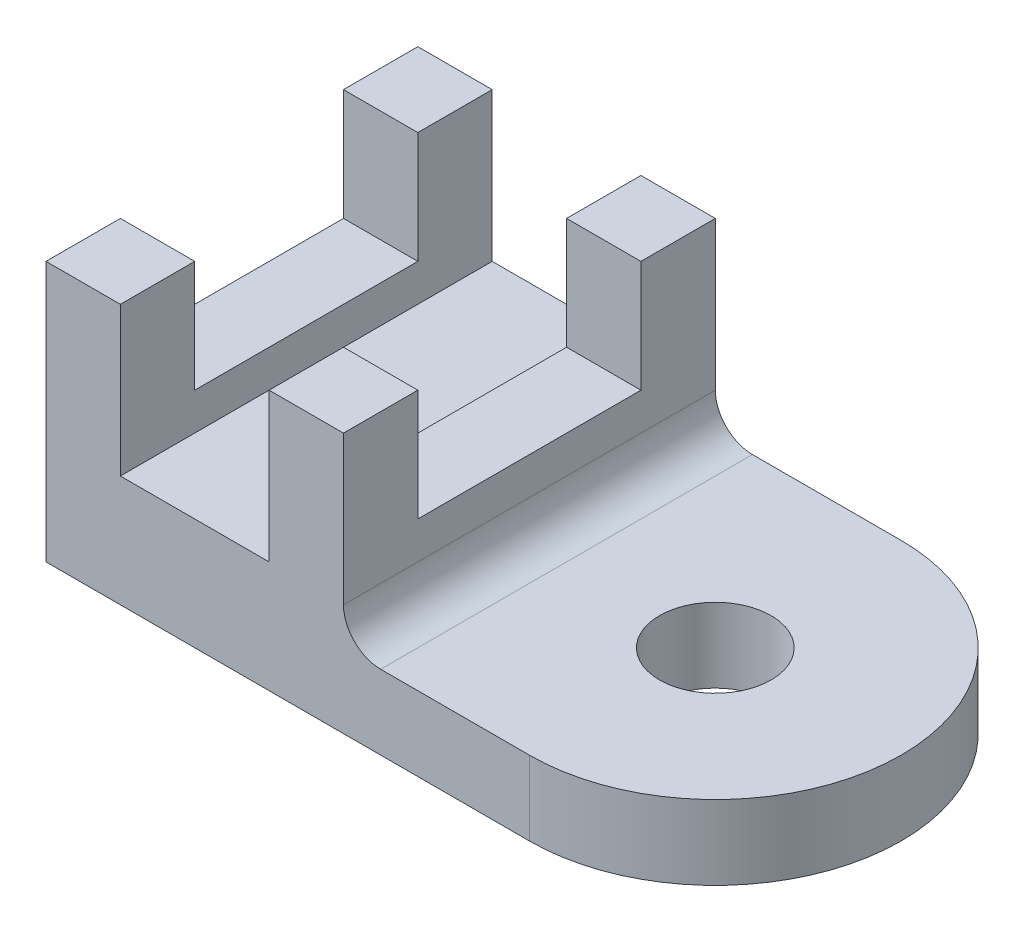
ISO-10303-21;
HEADER;
FILE_DESCRIPTION(('STEP AP214'),'2;1');
FILE_NAME('part.step','',(''),(''),'','','');
FILE_SCHEMA(('AUTOMOTIVE_DESIGN { 1 0 10303 214 1 1 1 1 }'));
ENDSEC;
DATA;
#1=APPLICATION_CONTEXT('core data for automotive mechanical design processes');
#2=APPLICATION_PROTOCOL_DEFINITION('international standard','automotive_design',2000,#1);
#3=PRODUCT_CONTEXT('',#1,'mechanical');
#4=PRODUCT('Part','Part','',(#3));
#5=PRODUCT_RELATED_PRODUCT_CATEGORY('part','',(#4));
#6=PRODUCT_DEFINITION_FORMATION('','',#4);
#7=PRODUCT_DEFINITION_CONTEXT('part definition',#1,'design');
#8=PRODUCT_DEFINITION('design','',#6,#7);
#9=PRODUCT_DEFINITION_SHAPE('','',#8);
#10=(LENGTH_UNIT() NAMED_UNIT(*) SI_UNIT(.MILLI.,.METRE.));
#11=(NAMED_UNIT(*) PLANE_ANGLE_UNIT() SI_UNIT($,.RADIAN.));
#12=(NAMED_UNIT(*) SI_UNIT($,.STERADIAN.) SOLID_ANGLE_UNIT());
#13=UNCERTAINTY_MEASURE_WITH_UNIT(LENGTH_MEASURE(1.E-05),#10,'distance_accuracy_value','');
#14=(GEOMETRIC_REPRESENTATION_CONTEXT(3) GLOBAL_UNCERTAINTY_ASSIGNED_CONTEXT((#13)) GLOBAL_UNIT_ASSIGNED_CONTEXT((#10,
#11,#12)) REPRESENTATION_CONTEXT('',''));
#15=CARTESIAN_POINT('',(0.,0.,0.));
#16=DIRECTION('',(0.,0.,1.));
#17=DIRECTION('',(1.,0.,0.));
#18=AXIS2_PLACEMENT_3D('',#15,#16,#17);
#19=CARTESIAN_POINT('',(0.,19.05,0.));
#20=DIRECTION('',(0.,1.,0.));
#21=DIRECTION('',(0.,0.,1.));
#22=AXIS2_PLACEMENT_3D('',#19,#20,#21);
#23=PLANE('',#22);
#24=DIRECTION('',(1.,0.,0.));
#25=VECTOR('',#24,1.);
#26=CARTESIAN_POINT('',(0.,19.05,0.));
#27=LINE('',#26,#25);
#28=CARTESIAN_POINT('',(12.7,19.05,0.));
#29=VERTEX_POINT('',#28);
#30=CARTESIAN_POINT('',(38.1,19.05,0.));
#31=VERTEX_POINT('',#30);
#32=EDGE_CURVE('E262',#29,#31,#27,.T.);
#33=ORIENTED_EDGE('',*,*,#32,.T.);
#34=DIRECTION('',(0.,0.,1.));
#35=VECTOR('',#34,1.);
#36=CARTESIAN_POINT('',(38.1,19.05,0.));
#37=LINE('',#36,#35);
#38=CARTESIAN_POINT('',(38.1,19.05,-63.5));
#39=VERTEX_POINT('',#38);
#40=EDGE_CURVE('E193',#39,#31,#37,.T.);
#41=ORIENTED_EDGE('',*,*,#40,.F.);
#42=DIRECTION('',(1.,0.,0.));
#43=VECTOR('',#42,1.);
#44=CARTESIAN_POINT('',(0.,19.05,-63.5));
#45=LINE('',#44,#43);
#46=CARTESIAN_POINT('',(12.7,19.05,-63.5));
#47=VERTEX_POINT('',#46);
#48=EDGE_CURVE('E259',#47,#39,#45,.T.);
#49=ORIENTED_EDGE('',*,*,#48,.F.);
#50=DIRECTION('',(0.,0.,1.));
#51=VECTOR('',#50,1.);
#52=CARTESIAN_POINT('',(12.7,19.05,0.));
#53=LINE('',#52,#51);
#54=EDGE_CURVE('E237',#47,#29,#53,.T.);
#55=ORIENTED_EDGE('',*,*,#54,.T.);
#56=EDGE_LOOP('',(#33,#41,#49,#55));
#57=FACE_BOUND('',#56,.T.);
#58=ADVANCED_FACE('F39',(#57),#23,.T.);
#59=CARTESIAN_POINT('',(82.55,12.7,-31.75));
#60=DIRECTION('',(0.,-1.,0.));
#61=DIRECTION('',(0.,0.,-1.));
#62=AXIS2_PLACEMENT_3D('',#59,#60,#61);
#63=CYLINDRICAL_SURFACE('',#62,31.75);
#64=CARTESIAN_POINT('',(82.55,0.,-31.75));
#65=DIRECTION('',(0.,1.,0.));
#66=DIRECTION('',(0.,0.,1.));
#67=AXIS2_PLACEMENT_3D('',#64,#65,#66);
#68=CIRCLE('',#67,31.75);
#69=CARTESIAN_POINT('',(82.55,0.,0.));
#70=VERTEX_POINT('',#69);
#71=CARTESIAN_POINT('',(82.55,0.,-63.5));
#72=VERTEX_POINT('',#71);
#73=EDGE_CURVE('E277',#70,#72,#68,.T.);
#74=ORIENTED_EDGE('',*,*,#73,.T.);
#75=DIRECTION('',(0.,-1.,0.));
#76=VECTOR('',#75,1.);
#77=CARTESIAN_POINT('',(82.55,12.7,-63.5));
#78=LINE('',#77,#76);
#79=CARTESIAN_POINT('',(82.55,12.7,-63.5));
#80=VERTEX_POINT('',#79);
#81=EDGE_CURVE('E301',#80,#72,#78,.T.);
#82=ORIENTED_EDGE('',*,*,#81,.F.);
#83=CARTESIAN_POINT('',(82.55,12.7,-31.75));
#84=DIRECTION('',(0.,1.,0.));
#85=DIRECTION('',(0.,0.,1.));
#86=AXIS2_PLACEMENT_3D('',#83,#84,#85);
#87=CIRCLE('',#86,31.75);
#88=CARTESIAN_POINT('',(82.55,12.7,0.));
#89=VERTEX_POINT('',#88);
#90=EDGE_CURVE('E278',#89,#80,#87,.T.);
#91=ORIENTED_EDGE('',*,*,#90,.F.);
#92=DIRECTION('',(0.,-1.,0.));
#93=VECTOR('',#92,1.);
#94=CARTESIAN_POINT('',(82.55,12.7,0.));
#95=LINE('',#94,#93);
#96=EDGE_CURVE('E289',#89,#70,#95,.T.);
#97=ORIENTED_EDGE('',*,*,#96,.T.);
#98=EDGE_LOOP('',(#74,#82,#91,#97));
#99=FACE_BOUND('',#98,.T.);
#100=ADVANCED_FACE('F319',(#99),#63,.T.);
#101=CARTESIAN_POINT('',(0.,12.7,-63.5));
#102=DIRECTION('',(0.,0.,-1.));
#103=DIRECTION('',(-1.,0.,0.));
#104=AXIS2_PLACEMENT_3D('',#101,#102,#103);
#105=PLANE('',#104);
#106=DIRECTION('',(1.,0.,0.));
#107=VECTOR('',#106,1.);
#108=CARTESIAN_POINT('',(0.,0.,-63.5));
#109=LINE('',#108,#107);
#110=CARTESIAN_POINT('',(0.,0.,-63.5));
#111=VERTEX_POINT('',#110);
#112=EDGE_CURVE('E292',#111,#72,#109,.T.);
#113=ORIENTED_EDGE('',*,*,#112,.F.);
#114=DIRECTION('',(0.,-1.,0.));
#115=VECTOR('',#114,1.);
#116=CARTESIAN_POINT('',(0.,19.05,-63.5));
#117=LINE('',#116,#115);
#118=CARTESIAN_POINT('',(0.,44.45,-63.5));
#119=VERTEX_POINT('',#118);
#120=EDGE_CURVE('E274',#119,#111,#117,.T.);
#121=ORIENTED_EDGE('',*,*,#120,.F.);
#122=DIRECTION('',(-1.,0.,0.));
#123=VECTOR('',#122,1.);
#124=CARTESIAN_POINT('',(0.,44.45,-63.5));
#125=LINE('',#124,#123);
#126=CARTESIAN_POINT('',(12.7,44.45,-63.5));
#127=VERTEX_POINT('',#126);
#128=EDGE_CURVE('E246',#127,#119,#125,.T.);
#129=ORIENTED_EDGE('',*,*,#128,.F.);
#130=DIRECTION('',(0.,-1.,0.));
#131=VECTOR('',#130,1.);
#132=CARTESIAN_POINT('',(12.7,44.45,-63.5));
#133=LINE('',#132,#131);
#134=EDGE_CURVE('E249',#127,#47,#133,.T.);
#135=ORIENTED_EDGE('',*,*,#134,.T.);
#136=ORIENTED_EDGE('',*,*,#48,.T.);
#137=DIRECTION('',(0.,-1.,0.));
#138=VECTOR('',#137,1.);
#139=CARTESIAN_POINT('',(38.1,44.45,-63.5));
#140=LINE('',#139,#138);
#141=CARTESIAN_POINT('',(38.1,44.45,-63.5));
#142=VERTEX_POINT('',#141);
#143=EDGE_CURVE('E210',#142,#39,#140,.T.);
#144=ORIENTED_EDGE('',*,*,#143,.F.);
#145=DIRECTION('',(-1.,0.,0.));
#146=VECTOR('',#145,1.);
#147=CARTESIAN_POINT('',(0.,44.45,-63.5));
#148=LINE('',#147,#146);
#149=CARTESIAN_POINT('',(50.8,44.45,-63.5));
#150=VERTEX_POINT('',#149);
#151=EDGE_CURVE('E209',#150,#142,#148,.T.);
#152=ORIENTED_EDGE('',*,*,#151,.F.);
#153=DIRECTION('',(0.,-1.,0.));
#154=VECTOR('',#153,1.);
#155=CARTESIAN_POINT('',(50.8,19.05,-63.5));
#156=LINE('',#155,#154);
#157=CARTESIAN_POINT('',(50.8,19.05,-63.5));
#158=VERTEX_POINT('',#157);
#159=EDGE_CURVE('E265',#150,#158,#156,.T.);
#160=ORIENTED_EDGE('',*,*,#159,.T.);
#161=CARTESIAN_POINT('',(57.15,19.05,-63.5));
#162=DIRECTION('',(0.,0.,-1.));
#163=DIRECTION('',(-1.,0.,0.));
#164=AXIS2_PLACEMENT_3D('',#161,#162,#163);
#165=CIRCLE('',#164,6.35);
#166=CARTESIAN_POINT('',(57.15,12.7,-63.5));
#167=VERTEX_POINT('',#166);
#168=EDGE_CURVE('E11',#158,#167,#165,.F.);
#169=ORIENTED_EDGE('',*,*,#168,.T.);
#170=DIRECTION('',(1.,0.,0.));
#171=VECTOR('',#170,1.);
#172=CARTESIAN_POINT('',(0.,12.7,-63.5));
#173=LINE('',#172,#171);
#174=EDGE_CURVE('E281',#167,#80,#173,.T.);
#175=ORIENTED_EDGE('',*,*,#174,.T.);
#176=ORIENTED_EDGE('',*,*,#81,.T.);
#177=EDGE_LOOP('',(#113,#121,#129,#135,#136,#144,#152,#160,#169,#175,#176));
#178=FACE_BOUND('',#177,.T.);
#179=ADVANCED_FACE('F321',(#178),#105,.T.);
#180=CARTESIAN_POINT('',(0.,12.7,0.));
#181=DIRECTION('',(0.,0.,-1.));
#182=DIRECTION('',(-1.,0.,0.));
#183=AXIS2_PLACEMENT_3D('',#180,#181,#182);
#184=PLANE('',#183);
#185=DIRECTION('',(1.,0.,0.));
#186=VECTOR('',#185,1.);
#187=CARTESIAN_POINT('',(0.,0.,0.));
#188=LINE('',#187,#186);
#189=CARTESIAN_POINT('',(0.,0.,0.));
#190=VERTEX_POINT('',#189);
#191=EDGE_CURVE('E295',#190,#70,#188,.T.);
#192=ORIENTED_EDGE('',*,*,#191,.T.);
#193=ORIENTED_EDGE('',*,*,#96,.F.);
#194=DIRECTION('',(1.,0.,0.));
#195=VECTOR('',#194,1.);
#196=CARTESIAN_POINT('',(0.,12.7,0.));
#197=LINE('',#196,#195);
#198=CARTESIAN_POINT('',(57.15,12.7,0.));
#199=VERTEX_POINT('',#198);
#200=EDGE_CURVE('E284',#199,#89,#197,.T.);
#201=ORIENTED_EDGE('',*,*,#200,.F.);
#202=CARTESIAN_POINT('',(57.15,19.05,0.));
#203=DIRECTION('',(0.,0.,-1.));
#204=DIRECTION('',(-1.,0.,0.));
#205=AXIS2_PLACEMENT_3D('',#202,#203,#204);
#206=CIRCLE('',#205,6.35);
#207=CARTESIAN_POINT('',(50.8,19.05,0.));
#208=VERTEX_POINT('',#207);
#209=EDGE_CURVE('E47',#199,#208,#206,.T.);
#210=ORIENTED_EDGE('',*,*,#209,.T.);
#211=DIRECTION('',(0.,-1.,0.));
#212=VECTOR('',#211,1.);
#213=CARTESIAN_POINT('',(50.8,19.05,0.));
#214=LINE('',#213,#212);
#215=CARTESIAN_POINT('',(50.8,44.45,0.));
#216=VERTEX_POINT('',#215);
#217=EDGE_CURVE('E269',#216,#208,#214,.T.);
#218=ORIENTED_EDGE('',*,*,#217,.F.);
#219=DIRECTION('',(1.,0.,0.));
#220=VECTOR('',#219,1.);
#221=CARTESIAN_POINT('',(0.,44.45,0.));
#222=LINE('',#221,#220);
#223=CARTESIAN_POINT('',(38.1,44.45,0.));
#224=VERTEX_POINT('',#223);
#225=EDGE_CURVE('E655',#224,#216,#222,.T.);
#226=ORIENTED_EDGE('',*,*,#225,.F.);
#227=DIRECTION('',(0.,-1.,0.));
#228=VECTOR('',#227,1.);
#229=CARTESIAN_POINT('',(38.1,44.45,0.));
#230=LINE('',#229,#228);
#231=EDGE_CURVE('E194',#224,#31,#230,.T.);
#232=ORIENTED_EDGE('',*,*,#231,.T.);
#233=ORIENTED_EDGE('',*,*,#32,.F.);
#234=DIRECTION('',(0.,-1.,0.));
#235=VECTOR('',#234,1.);
#236=CARTESIAN_POINT('',(12.7,44.45,0.));
#237=LINE('',#236,#235);
#238=CARTESIAN_POINT('',(12.7,44.45,0.));
#239=VERTEX_POINT('',#238);
#240=EDGE_CURVE('E231',#239,#29,#237,.T.);
#241=ORIENTED_EDGE('',*,*,#240,.F.);
#242=DIRECTION('',(1.,0.,0.));
#243=VECTOR('',#242,1.);
#244=CARTESIAN_POINT('',(0.,44.45,0.));
#245=LINE('',#244,#243);
#246=CARTESIAN_POINT('',(0.,44.45,0.));
#247=VERTEX_POINT('',#246);
#248=EDGE_CURVE('E224',#247,#239,#245,.T.);
#249=ORIENTED_EDGE('',*,*,#248,.F.);
#250=DIRECTION('',(0.,-1.,0.));
#251=VECTOR('',#250,1.);
#252=CARTESIAN_POINT('',(0.,19.05,0.));
#253=LINE('',#252,#251);
#254=EDGE_CURVE('E271',#247,#190,#253,.T.);
#255=ORIENTED_EDGE('',*,*,#254,.T.);
#256=EDGE_LOOP('',(#192,#193,#201,#210,#218,#226,#232,#233,#241,#249,#255));
#257=FACE_BOUND('',#256,.T.);
#258=ADVANCED_FACE('F314',(#257),#184,.F.);
#259=CARTESIAN_POINT('',(82.55,12.7,-31.75));
#260=DIRECTION('',(0.,-1.,0.));
#261=DIRECTION('',(0.,0.,-1.));
#262=AXIS2_PLACEMENT_3D('',#259,#260,#261);
#263=CYLINDRICAL_SURFACE('',#262,9.52500000000001);
#264=CARTESIAN_POINT('',(82.55,12.7,-31.75));
#265=DIRECTION('',(0.,1.,0.));
#266=DIRECTION('',(0.,0.,1.));
#267=AXIS2_PLACEMENT_3D('',#264,#265,#266);
#268=CIRCLE('',#267,9.52500000000001);
#269=CARTESIAN_POINT('',(82.55,12.7,-22.225));
#270=VERTEX_POINT('',#269);
#271=EDGE_CURVE('E286',#270,#270,#268,.T.);
#272=ORIENTED_EDGE('',*,*,#271,.T.);
#273=EDGE_LOOP('',(#272));
#274=FACE_BOUND('',#273,.T.);
#275=CARTESIAN_POINT('',(82.55,0.,-31.75));
#276=DIRECTION('',(0.,1.,0.));
#277=DIRECTION('',(0.,0.,1.));
#278=AXIS2_PLACEMENT_3D('',#275,#276,#277);
#279=CIRCLE('',#278,9.52500000000001);
#280=CARTESIAN_POINT('',(82.55,0.,-22.225));
#281=VERTEX_POINT('',#280);
#282=EDGE_CURVE('E282',#281,#281,#279,.T.);
#283=ORIENTED_EDGE('',*,*,#282,.F.);
#284=EDGE_LOOP('',(#283));
#285=FACE_BOUND('',#284,.T.);
#286=ADVANCED_FACE('F349',(#274,#285),#263,.F.);
#287=CARTESIAN_POINT('',(0.,12.7,0.));
#288=DIRECTION('',(0.,1.,0.));
#289=DIRECTION('',(0.,0.,1.));
#290=AXIS2_PLACEMENT_3D('',#287,#288,#289);
#291=PLANE('',#290);
#292=ORIENTED_EDGE('',*,*,#174,.F.);
#293=DIRECTION('',(0.,0.,1.));
#294=VECTOR('',#293,1.);
#295=CARTESIAN_POINT('',(57.15,12.7,0.));
#296=LINE('',#295,#294);
#297=EDGE_CURVE('E303',#167,#199,#296,.T.);
#298=ORIENTED_EDGE('',*,*,#297,.T.);
#299=ORIENTED_EDGE('',*,*,#200,.T.);
#300=ORIENTED_EDGE('',*,*,#90,.T.);
#301=EDGE_LOOP('',(#292,#298,#299,#300));
#302=FACE_BOUND('',#301,.T.);
#303=ORIENTED_EDGE('',*,*,#271,.F.);
#304=EDGE_LOOP('',(#303));
#305=FACE_BOUND('',#304,.T.);
#306=ADVANCED_FACE('F309',(#302,#305),#291,.T.);
#307=CARTESIAN_POINT('',(0.,0.,0.));
#308=DIRECTION('',(0.,1.,0.));
#309=DIRECTION('',(0.,0.,1.));
#310=AXIS2_PLACEMENT_3D('',#307,#308,#309);
#311=PLANE('',#310);
#312=ORIENTED_EDGE('',*,*,#73,.F.);
#313=ORIENTED_EDGE('',*,*,#191,.F.);
#314=DIRECTION('',(0.,0.,-1.));
#315=VECTOR('',#314,1.);
#316=CARTESIAN_POINT('',(0.,0.,0.));
#317=LINE('',#316,#315);
#318=EDGE_CURVE('E258',#190,#111,#317,.T.);
#319=ORIENTED_EDGE('',*,*,#318,.T.);
#320=ORIENTED_EDGE('',*,*,#112,.T.);
#321=EDGE_LOOP('',(#312,#313,#319,#320));
#322=FACE_BOUND('',#321,.T.);
#323=ORIENTED_EDGE('',*,*,#282,.T.);
#324=EDGE_LOOP('',(#323));
#325=FACE_BOUND('',#324,.T.);
#326=ADVANCED_FACE('F343',(#322,#325),#311,.F.);
#327=CARTESIAN_POINT('',(50.8,19.05,0.));
#328=DIRECTION('',(1.,0.,0.));
#329=DIRECTION('',(0.,0.,-1.));
#330=AXIS2_PLACEMENT_3D('',#327,#328,#329);
#331=PLANE('',#330);
#332=ORIENTED_EDGE('',*,*,#217,.T.);
#333=DIRECTION('',(0.,0.,1.));
#334=VECTOR('',#333,1.);
#335=CARTESIAN_POINT('',(50.8,19.05,-63.5));
#336=LINE('',#335,#334);
#337=EDGE_CURVE('E60',#208,#158,#336,.F.);
#338=ORIENTED_EDGE('',*,*,#337,.T.);
#339=ORIENTED_EDGE('',*,*,#159,.F.);
#340=DIRECTION('',(0.,0.,-1.));
#341=VECTOR('',#340,1.);
#342=CARTESIAN_POINT('',(50.8,44.45,0.));
#343=LINE('',#342,#341);
#344=CARTESIAN_POINT('',(50.8,44.45,-50.8));
#345=VERTEX_POINT('',#344);
#346=EDGE_CURVE('E206',#345,#150,#343,.T.);
#347=ORIENTED_EDGE('',*,*,#346,.F.);
#348=DIRECTION('',(0.,-1.,0.));
#349=VECTOR('',#348,1.);
#350=CARTESIAN_POINT('',(50.8,44.45,-50.8));
#351=LINE('',#350,#349);
#352=CARTESIAN_POINT('',(50.8,25.4,-50.8));
#353=VERTEX_POINT('',#352);
#354=EDGE_CURVE('E213',#345,#353,#351,.T.);
#355=ORIENTED_EDGE('',*,*,#354,.T.);
#356=DIRECTION('',(0.,0.,-1.));
#357=VECTOR('',#356,1.);
#358=CARTESIAN_POINT('',(50.8,25.4,0.));
#359=LINE('',#358,#357);
#360=CARTESIAN_POINT('',(50.8,25.4,-12.7));
#361=VERTEX_POINT('',#360);
#362=EDGE_CURVE('E187',#361,#353,#359,.T.);
#363=ORIENTED_EDGE('',*,*,#362,.F.);
#364=DIRECTION('',(0.,-1.,0.));
#365=VECTOR('',#364,1.);
#366=CARTESIAN_POINT('',(50.8,44.45,-12.7));
#367=LINE('',#366,#365);
#368=CARTESIAN_POINT('',(50.8,44.45,-12.7));
#369=VERTEX_POINT('',#368);
#370=EDGE_CURVE('E186',#369,#361,#367,.T.);
#371=ORIENTED_EDGE('',*,*,#370,.F.);
#372=DIRECTION('',(0.,0.,-1.));
#373=VECTOR('',#372,1.);
#374=CARTESIAN_POINT('',(50.8,44.45,0.));
#375=LINE('',#374,#373);
#376=EDGE_CURVE('E658',#216,#369,#375,.T.);
#377=ORIENTED_EDGE('',*,*,#376,.F.);
#378=EDGE_LOOP('',(#332,#338,#339,#347,#355,#363,#371,#377));
#379=FACE_BOUND('',#378,.T.);
#380=ADVANCED_FACE('F339',(#379),#331,.T.);
#381=CARTESIAN_POINT('',(0.,19.05,0.));
#382=DIRECTION('',(-1.,0.,0.));
#383=DIRECTION('',(0.,0.,1.));
#384=AXIS2_PLACEMENT_3D('',#381,#382,#383);
#385=PLANE('',#384);
#386=ORIENTED_EDGE('',*,*,#318,.F.);
#387=ORIENTED_EDGE('',*,*,#254,.F.);
#388=DIRECTION('',(0.,0.,1.));
#389=VECTOR('',#388,1.);
#390=CARTESIAN_POINT('',(0.,44.45,0.));
#391=LINE('',#390,#389);
#392=CARTESIAN_POINT('',(0.,44.45,-12.7));
#393=VERTEX_POINT('',#392);
#394=EDGE_CURVE('E221',#393,#247,#391,.T.);
#395=ORIENTED_EDGE('',*,*,#394,.F.);
#396=DIRECTION('',(0.,-1.,0.));
#397=VECTOR('',#396,1.);
#398=CARTESIAN_POINT('',(0.,44.45,-12.7));
#399=LINE('',#398,#397);
#400=CARTESIAN_POINT('',(0.,25.4,-12.7));
#401=VERTEX_POINT('',#400);
#402=EDGE_CURVE('E234',#393,#401,#399,.T.);
#403=ORIENTED_EDGE('',*,*,#402,.T.);
#404=DIRECTION('',(0.,0.,1.));
#405=VECTOR('',#404,1.);
#406=CARTESIAN_POINT('',(0.,25.4,0.));
#407=LINE('',#406,#405);
#408=CARTESIAN_POINT('',(0.,25.4,-50.8));
#409=VERTEX_POINT('',#408);
#410=EDGE_CURVE('E638',#409,#401,#407,.T.);
#411=ORIENTED_EDGE('',*,*,#410,.F.);
#412=DIRECTION('',(0.,-1.,0.));
#413=VECTOR('',#412,1.);
#414=CARTESIAN_POINT('',(0.,44.45,-50.8));
#415=LINE('',#414,#413);
#416=CARTESIAN_POINT('',(0.,44.45,-50.8));
#417=VERTEX_POINT('',#416);
#418=EDGE_CURVE('E256',#417,#409,#415,.T.);
#419=ORIENTED_EDGE('',*,*,#418,.F.);
#420=DIRECTION('',(0.,0.,1.));
#421=VECTOR('',#420,1.);
#422=CARTESIAN_POINT('',(0.,44.45,0.));
#423=LINE('',#422,#421);
#424=EDGE_CURVE('E238',#119,#417,#423,.T.);
#425=ORIENTED_EDGE('',*,*,#424,.F.);
#426=ORIENTED_EDGE('',*,*,#120,.T.);
#427=EDGE_LOOP('',(#386,#387,#395,#403,#411,#419,#425,#426));
#428=FACE_BOUND('',#427,.T.);
#429=ADVANCED_FACE('F342',(#428),#385,.T.);
#430=CARTESIAN_POINT('',(0.,44.45,-50.8));
#431=DIRECTION('',(0.,0.,-1.));
#432=DIRECTION('',(-1.,0.,0.));
#433=AXIS2_PLACEMENT_3D('',#430,#431,#432);
#434=PLANE('',#433);
#435=ORIENTED_EDGE('',*,*,#418,.T.);
#436=DIRECTION('',(1.,0.,0.));
#437=VECTOR('',#436,1.);
#438=CARTESIAN_POINT('',(0.,25.4,-50.8));
#439=LINE('',#438,#437);
#440=CARTESIAN_POINT('',(12.7,25.4,-50.8));
#441=VERTEX_POINT('',#440);
#442=EDGE_CURVE('E642',#409,#441,#439,.T.);
#443=ORIENTED_EDGE('',*,*,#442,.T.);
#444=DIRECTION('',(0.,-1.,0.));
#445=VECTOR('',#444,1.);
#446=CARTESIAN_POINT('',(12.7,44.45,-50.8));
#447=LINE('',#446,#445);
#448=CARTESIAN_POINT('',(12.7,44.45,-50.8));
#449=VERTEX_POINT('',#448);
#450=EDGE_CURVE('E253',#449,#441,#447,.T.);
#451=ORIENTED_EDGE('',*,*,#450,.F.);
#452=DIRECTION('',(1.,0.,0.));
#453=VECTOR('',#452,1.);
#454=CARTESIAN_POINT('',(0.,44.45,-50.8));
#455=LINE('',#454,#453);
#456=EDGE_CURVE('E241',#417,#449,#455,.T.);
#457=ORIENTED_EDGE('',*,*,#456,.F.);
#458=EDGE_LOOP('',(#435,#443,#451,#457));
#459=FACE_BOUND('',#458,.T.);
#460=ADVANCED_FACE('F337',(#459),#434,.F.);
#461=CARTESIAN_POINT('',(12.7,44.45,0.));
#462=DIRECTION('',(1.,0.,0.));
#463=DIRECTION('',(0.,0.,-1.));
#464=AXIS2_PLACEMENT_3D('',#461,#462,#463);
#465=PLANE('',#464);
#466=ORIENTED_EDGE('',*,*,#54,.F.);
#467=ORIENTED_EDGE('',*,*,#134,.F.);
#468=DIRECTION('',(0.,0.,1.));
#469=VECTOR('',#468,1.);
#470=CARTESIAN_POINT('',(12.7,44.45,0.));
#471=LINE('',#470,#469);
#472=EDGE_CURVE('E243',#127,#449,#471,.T.);
#473=ORIENTED_EDGE('',*,*,#472,.T.);
#474=ORIENTED_EDGE('',*,*,#450,.T.);
#475=DIRECTION('',(0.,0.,1.));
#476=VECTOR('',#475,1.);
#477=CARTESIAN_POINT('',(12.7,25.4,0.));
#478=LINE('',#477,#476);
#479=CARTESIAN_POINT('',(12.7,25.4,-12.7));
#480=VERTEX_POINT('',#479);
#481=EDGE_CURVE('E645',#441,#480,#478,.T.);
#482=ORIENTED_EDGE('',*,*,#481,.T.);
#483=DIRECTION('',(0.,-1.,0.));
#484=VECTOR('',#483,1.);
#485=CARTESIAN_POINT('',(12.7,44.45,-12.7));
#486=LINE('',#485,#484);
#487=CARTESIAN_POINT('',(12.7,44.45,-12.7));
#488=VERTEX_POINT('',#487);
#489=EDGE_CURVE('E229',#488,#480,#486,.T.);
#490=ORIENTED_EDGE('',*,*,#489,.F.);
#491=DIRECTION('',(0.,0.,1.));
#492=VECTOR('',#491,1.);
#493=CARTESIAN_POINT('',(12.7,44.45,0.));
#494=LINE('',#493,#492);
#495=EDGE_CURVE('E226',#488,#239,#494,.T.);
#496=ORIENTED_EDGE('',*,*,#495,.T.);
#497=ORIENTED_EDGE('',*,*,#240,.T.);
#498=EDGE_LOOP('',(#466,#467,#473,#474,#482,#490,#496,#497));
#499=FACE_BOUND('',#498,.T.);
#500=ADVANCED_FACE('F395',(#499),#465,.T.);
#501=CARTESIAN_POINT('',(0.,44.45,0.));
#502=DIRECTION('',(0.,1.,0.));
#503=DIRECTION('',(0.,0.,1.));
#504=AXIS2_PLACEMENT_3D('',#501,#502,#503);
#505=PLANE('',#504);
#506=ORIENTED_EDGE('',*,*,#424,.T.);
#507=ORIENTED_EDGE('',*,*,#456,.T.);
#508=ORIENTED_EDGE('',*,*,#472,.F.);
#509=ORIENTED_EDGE('',*,*,#128,.T.);
#510=EDGE_LOOP('',(#506,#507,#508,#509));
#511=FACE_BOUND('',#510,.T.);
#512=ADVANCED_FACE('F402',(#511),#505,.T.);
#513=CARTESIAN_POINT('',(0.,44.45,-12.7));
#514=DIRECTION('',(0.,0.,-1.));
#515=DIRECTION('',(-1.,0.,0.));
#516=AXIS2_PLACEMENT_3D('',#513,#514,#515);
#517=PLANE('',#516);
#518=DIRECTION('',(1.,0.,0.));
#519=VECTOR('',#518,1.);
#520=CARTESIAN_POINT('',(0.,25.4,-12.7));
#521=LINE('',#520,#519);
#522=EDGE_CURVE('E640',#401,#480,#521,.T.);
#523=ORIENTED_EDGE('',*,*,#522,.F.);
#524=ORIENTED_EDGE('',*,*,#402,.F.);
#525=DIRECTION('',(1.,0.,0.));
#526=VECTOR('',#525,1.);
#527=CARTESIAN_POINT('',(0.,44.45,-12.7));
#528=LINE('',#527,#526);
#529=EDGE_CURVE('E218',#393,#488,#528,.T.);
#530=ORIENTED_EDGE('',*,*,#529,.T.);
#531=ORIENTED_EDGE('',*,*,#489,.T.);
#532=EDGE_LOOP('',(#523,#524,#530,#531));
#533=FACE_BOUND('',#532,.T.);
#534=ADVANCED_FACE('F409',(#533),#517,.T.);
#535=CARTESIAN_POINT('',(0.,44.45,0.));
#536=DIRECTION('',(0.,1.,0.));
#537=DIRECTION('',(0.,0.,1.));
#538=AXIS2_PLACEMENT_3D('',#535,#536,#537);
#539=PLANE('',#538);
#540=ORIENTED_EDGE('',*,*,#529,.F.);
#541=ORIENTED_EDGE('',*,*,#394,.T.);
#542=ORIENTED_EDGE('',*,*,#248,.T.);
#543=ORIENTED_EDGE('',*,*,#495,.F.);
#544=EDGE_LOOP('',(#540,#541,#542,#543));
#545=FACE_BOUND('',#544,.T.);
#546=ADVANCED_FACE('F417',(#545),#539,.T.);
#547=CARTESIAN_POINT('',(38.1,44.45,0.));
#548=DIRECTION('',(1.,0.,0.));
#549=DIRECTION('',(0.,0.,-1.));
#550=AXIS2_PLACEMENT_3D('',#547,#548,#549);
#551=PLANE('',#550);
#552=ORIENTED_EDGE('',*,*,#40,.T.);
#553=ORIENTED_EDGE('',*,*,#231,.F.);
#554=DIRECTION('',(0.,0.,1.));
#555=VECTOR('',#554,1.);
#556=CARTESIAN_POINT('',(38.1,44.45,0.));
#557=LINE('',#556,#555);
#558=CARTESIAN_POINT('',(38.1,44.45,-12.7));
#559=VERTEX_POINT('',#558);
#560=EDGE_CURVE('E191',#559,#224,#557,.T.);
#561=ORIENTED_EDGE('',*,*,#560,.F.);
#562=DIRECTION('',(0.,-1.,0.));
#563=VECTOR('',#562,1.);
#564=CARTESIAN_POINT('',(38.1,44.45,-12.7));
#565=LINE('',#564,#563);
#566=CARTESIAN_POINT('',(38.1,25.4,-12.7));
#567=VERTEX_POINT('',#566);
#568=EDGE_CURVE('E183',#559,#567,#565,.T.);
#569=ORIENTED_EDGE('',*,*,#568,.T.);
#570=DIRECTION('',(0.,0.,1.));
#571=VECTOR('',#570,1.);
#572=CARTESIAN_POINT('',(38.1,25.4,0.));
#573=LINE('',#572,#571);
#574=CARTESIAN_POINT('',(38.1,25.4,-50.8));
#575=VERTEX_POINT('',#574);
#576=EDGE_CURVE('E167',#575,#567,#573,.T.);
#577=ORIENTED_EDGE('',*,*,#576,.F.);
#578=DIRECTION('',(0.,-1.,0.));
#579=VECTOR('',#578,1.);
#580=CARTESIAN_POINT('',(38.1,44.45,-50.8));
#581=LINE('',#580,#579);
#582=CARTESIAN_POINT('',(38.1,44.45,-50.8));
#583=VERTEX_POINT('',#582);
#584=EDGE_CURVE('E216',#583,#575,#581,.T.);
#585=ORIENTED_EDGE('',*,*,#584,.F.);
#586=DIRECTION('',(0.,0.,1.));
#587=VECTOR('',#586,1.);
#588=CARTESIAN_POINT('',(38.1,44.45,0.));
#589=LINE('',#588,#587);
#590=EDGE_CURVE('E196',#142,#583,#589,.T.);
#591=ORIENTED_EDGE('',*,*,#590,.F.);
#592=ORIENTED_EDGE('',*,*,#143,.T.);
#593=EDGE_LOOP('',(#552,#553,#561,#569,#577,#585,#591,#592));
#594=FACE_BOUND('',#593,.T.);
#595=ADVANCED_FACE('F189',(#594),#551,.F.);
#596=CARTESIAN_POINT('',(0.,44.45,-50.8));
#597=DIRECTION('',(0.,0.,-1.));
#598=DIRECTION('',(-1.,0.,0.));
#599=AXIS2_PLACEMENT_3D('',#596,#597,#598);
#600=PLANE('',#599);
#601=ORIENTED_EDGE('',*,*,#584,.T.);
#602=DIRECTION('',(1.,0.,0.));
#603=VECTOR('',#602,1.);
#604=CARTESIAN_POINT('',(0.,25.4,-50.8));
#605=LINE('',#604,#603);
#606=EDGE_CURVE('E173',#575,#353,#605,.T.);
#607=ORIENTED_EDGE('',*,*,#606,.T.);
#608=ORIENTED_EDGE('',*,*,#354,.F.);
#609=DIRECTION('',(1.,0.,0.));
#610=VECTOR('',#609,1.);
#611=CARTESIAN_POINT('',(0.,44.45,-50.8));
#612=LINE('',#611,#610);
#613=EDGE_CURVE('E204',#583,#345,#612,.T.);
#614=ORIENTED_EDGE('',*,*,#613,.F.);
#615=EDGE_LOOP('',(#601,#607,#608,#614));
#616=FACE_BOUND('',#615,.T.);
#617=ADVANCED_FACE('F432',(#616),#600,.F.);
#618=CARTESIAN_POINT('',(0.,44.45,0.));
#619=DIRECTION('',(0.,1.,0.));
#620=DIRECTION('',(0.,0.,1.));
#621=AXIS2_PLACEMENT_3D('',#618,#619,#620);
#622=PLANE('',#621);
#623=ORIENTED_EDGE('',*,*,#590,.T.);
#624=ORIENTED_EDGE('',*,*,#613,.T.);
#625=ORIENTED_EDGE('',*,*,#346,.T.);
#626=ORIENTED_EDGE('',*,*,#151,.T.);
#627=EDGE_LOOP('',(#623,#624,#625,#626));
#628=FACE_BOUND('',#627,.T.);
#629=ADVANCED_FACE('F439',(#628),#622,.T.);
#630=CARTESIAN_POINT('',(0.,44.45,-12.7));
#631=DIRECTION('',(0.,0.,-1.));
#632=DIRECTION('',(-1.,0.,0.));
#633=AXIS2_PLACEMENT_3D('',#630,#631,#632);
#634=PLANE('',#633);
#635=DIRECTION('',(1.,0.,0.));
#636=VECTOR('',#635,1.);
#637=CARTESIAN_POINT('',(0.,25.4,-12.7));
#638=LINE('',#637,#636);
#639=EDGE_CURVE('E170',#567,#361,#638,.T.);
#640=ORIENTED_EDGE('',*,*,#639,.F.);
#641=ORIENTED_EDGE('',*,*,#568,.F.);
#642=DIRECTION('',(1.,0.,0.));
#643=VECTOR('',#642,1.);
#644=CARTESIAN_POINT('',(0.,44.45,-12.7));
#645=LINE('',#644,#643);
#646=EDGE_CURVE('E652',#559,#369,#645,.T.);
#647=ORIENTED_EDGE('',*,*,#646,.T.);
#648=ORIENTED_EDGE('',*,*,#370,.T.);
#649=EDGE_LOOP('',(#640,#641,#647,#648));
#650=FACE_BOUND('',#649,.T.);
#651=ADVANCED_FACE('F181',(#650),#634,.T.);
#652=CARTESIAN_POINT('',(0.,44.45,0.));
#653=DIRECTION('',(0.,1.,0.));
#654=DIRECTION('',(0.,0.,1.));
#655=AXIS2_PLACEMENT_3D('',#652,#653,#654);
#656=PLANE('',#655);
#657=ORIENTED_EDGE('',*,*,#646,.F.);
#658=ORIENTED_EDGE('',*,*,#560,.T.);
#659=ORIENTED_EDGE('',*,*,#225,.T.);
#660=ORIENTED_EDGE('',*,*,#376,.T.);
#661=EDGE_LOOP('',(#657,#658,#659,#660));
#662=FACE_BOUND('',#661,.T.);
#663=ADVANCED_FACE('F454',(#662),#656,.T.);
#664=CARTESIAN_POINT('',(0.,25.4,0.));
#665=DIRECTION('',(0.,1.,0.));
#666=DIRECTION('',(0.,0.,1.));
#667=AXIS2_PLACEMENT_3D('',#664,#665,#666);
#668=PLANE('',#667);
#669=ORIENTED_EDGE('',*,*,#410,.T.);
#670=ORIENTED_EDGE('',*,*,#522,.T.);
#671=ORIENTED_EDGE('',*,*,#481,.F.);
#672=ORIENTED_EDGE('',*,*,#442,.F.);
#673=EDGE_LOOP('',(#669,#670,#671,#672));
#674=FACE_BOUND('',#673,.T.);
#675=ADVANCED_FACE('F327',(#674),#668,.T.);
#676=CARTESIAN_POINT('',(0.,25.4,0.));
#677=DIRECTION('',(0.,1.,0.));
#678=DIRECTION('',(0.,0.,1.));
#679=AXIS2_PLACEMENT_3D('',#676,#677,#678);
#680=PLANE('',#679);
#681=ORIENTED_EDGE('',*,*,#576,.T.);
#682=ORIENTED_EDGE('',*,*,#639,.T.);
#683=ORIENTED_EDGE('',*,*,#362,.T.);
#684=ORIENTED_EDGE('',*,*,#606,.F.);
#685=EDGE_LOOP('',(#681,#682,#683,#684));
#686=FACE_BOUND('',#685,.T.);
#687=ADVANCED_FACE('F169',(#686),#680,.T.);
#688=CARTESIAN_POINT('',(57.15,19.05,0.));
#689=DIRECTION('',(0.,0.,-1.));
#690=DIRECTION('',(-1.,0.,0.));
#691=AXIS2_PLACEMENT_3D('',#688,#689,#690);
#692=CYLINDRICAL_SURFACE('',#691,6.35);
#693=ORIENTED_EDGE('',*,*,#168,.F.);
#694=ORIENTED_EDGE('',*,*,#337,.F.);
#695=ORIENTED_EDGE('',*,*,#209,.F.);
#696=ORIENTED_EDGE('',*,*,#297,.F.);
#697=EDGE_LOOP('',(#693,#694,#695,#696));
#698=FACE_BOUND('',#697,.T.);
#699=ADVANCED_FACE('F41',(#698),#692,.F.);
#700=CLOSED_SHELL('',(#58,#100,#179,#258,#286,#306,#326,#380,#429,#460,#500,#512,#534,#546,#595,
#617,#629,#651,#663,#675,#687,#699));
#701=MANIFOLD_SOLID_BREP('B2',#700);
#702=ADVANCED_BREP_SHAPE_REPRESENTATION('',(#18,#701),#14);
#703=SHAPE_DEFINITION_REPRESENTATION(#9,#702);
ENDSEC;
END-ISO-10303-21;
